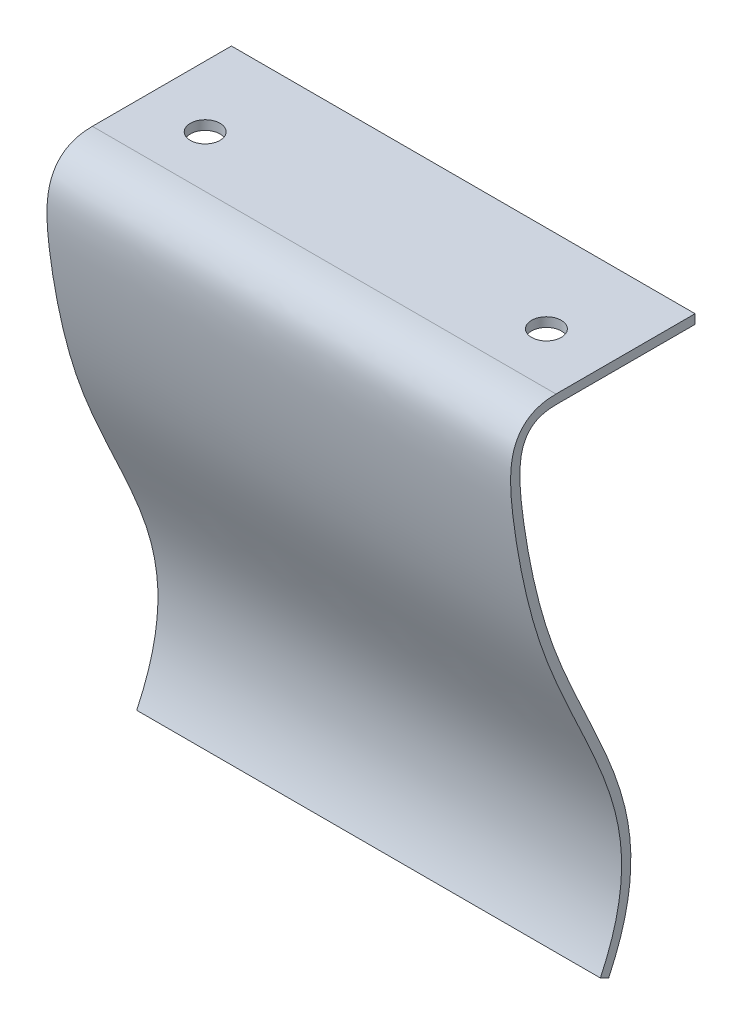
ISO-10303-21;
HEADER;
FILE_DESCRIPTION(('STEP AP214'),'2;1');
FILE_NAME('part.step','',(''),(''),'','','');
FILE_SCHEMA(('AUTOMOTIVE_DESIGN { 1 0 10303 214 1 1 1 1 }'));
ENDSEC;
DATA;
#1=APPLICATION_CONTEXT('core data for automotive mechanical design processes');
#2=APPLICATION_PROTOCOL_DEFINITION('international standard','automotive_design',2000,#1);
#3=PRODUCT_CONTEXT('',#1,'mechanical');
#4=PRODUCT('Part','Part','',(#3));
#5=PRODUCT_RELATED_PRODUCT_CATEGORY('part','',(#4));
#6=PRODUCT_DEFINITION_FORMATION('','',#4);
#7=PRODUCT_DEFINITION_CONTEXT('part definition',#1,'design');
#8=PRODUCT_DEFINITION('design','',#6,#7);
#9=PRODUCT_DEFINITION_SHAPE('','',#8);
#10=(LENGTH_UNIT() NAMED_UNIT(*) SI_UNIT(.MILLI.,.METRE.));
#11=(NAMED_UNIT(*) PLANE_ANGLE_UNIT() SI_UNIT($,.RADIAN.));
#12=(NAMED_UNIT(*) SI_UNIT($,.STERADIAN.) SOLID_ANGLE_UNIT());
#13=UNCERTAINTY_MEASURE_WITH_UNIT(LENGTH_MEASURE(1.E-05),#10,'distance_accuracy_value','');
#14=(GEOMETRIC_REPRESENTATION_CONTEXT(3) GLOBAL_UNCERTAINTY_ASSIGNED_CONTEXT((#13)) GLOBAL_UNIT_ASSIGNED_CONTEXT((#10,
#11,#12)) REPRESENTATION_CONTEXT('',''));
#15=CARTESIAN_POINT('',(0.,0.,0.));
#16=DIRECTION('',(0.,0.,1.));
#17=DIRECTION('',(1.,0.,0.));
#18=AXIS2_PLACEMENT_3D('',#15,#16,#17);
#19=CARTESIAN_POINT('',(50.,55.6225268925839,28.9315421718179));
#20=CARTESIAN_POINT('',(50.,55.6225268925839,29.5495301344915));
#21=CARTESIAN_POINT('',(50.,55.5566902092723,30.1141381036788));
#22=CARTESIAN_POINT('',(50.,55.2739407543996,31.1474005668499));
#23=CARTESIAN_POINT('',(50.,55.0542905873446,31.6162636528642));
#24=CARTESIAN_POINT('',(50.,54.4625233474366,32.4201172705438));
#25=CARTESIAN_POINT('',(50.,54.092295289197,32.7508722621553));
#26=CARTESIAN_POINT('',(50.,53.2681372067847,33.2584619481065));
#27=CARTESIAN_POINT('',(50.,52.8163288103807,33.4377510947691));
#28=CARTESIAN_POINT('',(50.,51.8647218768885,33.6889737009552));
#29=CARTESIAN_POINT('',(50.,51.3635518326052,33.7617957884789));
#30=CARTESIAN_POINT('',(50.,50.3127342333181,33.8358690496996));
#31=CARTESIAN_POINT('',(50.,49.7626729618878,33.8368472991819));
#32=CARTESIAN_POINT('',(50.,48.6136240125153,33.7889314955515));
#33=CARTESIAN_POINT('',(50.,48.0146306456055,33.7398721279512));
#34=CARTESIAN_POINT('',(50.,46.7711993394758,33.6090180869856));
#35=CARTESIAN_POINT('',(50.,46.1277071075903,33.5281899659987));
#36=CARTESIAN_POINT('',(50.,42.7917721000767,33.0664118071396));
#37=CARTESIAN_POINT('',(50.,39.7631098520036,32.4964336560825));
#38=CARTESIAN_POINT('',(50.,35.2938198277185,31.3171714152319));
#39=CARTESIAN_POINT('',(50.,33.8165219322822,30.8673443038037));
#40=CARTESIAN_POINT('',(50.,30.9886208921199,29.8658741634841));
#41=CARTESIAN_POINT('',(50.,29.6304834625541,29.3190360197982));
#42=CARTESIAN_POINT('',(50.,25.6866943233672,27.6203239020023));
#43=CARTESIAN_POINT('',(50.,23.2311976251864,26.4110003028312));
#44=CARTESIAN_POINT('',(50.,18.4733935224935,24.2514211214052));
#45=CARTESIAN_POINT('',(50.,16.1720681135011,23.3021197839043));
#46=CARTESIAN_POINT('',(50.,11.534502138506,22.041511098354));
#47=CARTESIAN_POINT('',(50.,9.20151696159139,21.7269450226703));
#48=CARTESIAN_POINT('',(50.,4.2424404774325,22.0843225688067));
#49=CARTESIAN_POINT('',(50.,1.60854700088082,22.7558749892393));
#50=CARTESIAN_POINT('',(50.,-1.31322203982244,24.1433398181167));
#51=B_SPLINE_CURVE_WITH_KNOTS('',3,(#19,#20,#21,#22,#23,#24,#25,#26,#27,#28,#29,#30,#31,#32,#33,
#34,#35,#36,#37,#38,#39,#40,#41,#42,#43,#44,#45,#46,#47,#48,#49,#50),.UNSPECIFIED.,.F.,.F.,(4,2,
2,2,2,2,2,2,2,2,2,2,2,2,2,4),(0.,0.0312499999999998,0.0624999999999997,0.0937499999999995,
0.124999999999999,0.156249999999999,0.187499999999999,0.218749999999999,0.249999999999999,
0.374999999999999,0.437499999999999,0.499999999999999,0.624999999999999,0.75,0.875,1.),.UNSPECIFIED.);
#52=DIRECTION('',(-1.,0.,0.));
#53=VECTOR('',#52,1.);
#54=SURFACE_OF_LINEAR_EXTRUSION('',#51,#53);
#55=CARTESIAN_POINT('',(0.,55.6225268925839,28.9315421718179));
#56=CARTESIAN_POINT('',(0.,55.6225268925839,29.5495301344915));
#57=CARTESIAN_POINT('',(0.,55.5566902092723,30.1141381036788));
#58=CARTESIAN_POINT('',(0.,55.2739407543996,31.1474005668499));
#59=CARTESIAN_POINT('',(0.,55.0542905873446,31.6162636528642));
#60=CARTESIAN_POINT('',(0.,54.4625233474366,32.4201172705438));
#61=CARTESIAN_POINT('',(0.,54.092295289197,32.7508722621553));
#62=CARTESIAN_POINT('',(0.,53.2681372067847,33.2584619481065));
#63=CARTESIAN_POINT('',(0.,52.8163288103807,33.4377510947691));
#64=CARTESIAN_POINT('',(0.,51.8647218768885,33.6889737009552));
#65=CARTESIAN_POINT('',(0.,51.3635518326052,33.7617957884789));
#66=CARTESIAN_POINT('',(0.,50.3127342333181,33.8358690496996));
#67=CARTESIAN_POINT('',(0.,49.7626729618878,33.8368472991819));
#68=CARTESIAN_POINT('',(0.,48.6136240125153,33.7889314955515));
#69=CARTESIAN_POINT('',(0.,48.0146306456055,33.7398721279512));
#70=CARTESIAN_POINT('',(0.,46.7711993394758,33.6090180869856));
#71=CARTESIAN_POINT('',(0.,46.1277071075903,33.5281899659987));
#72=CARTESIAN_POINT('',(0.,42.7917721000767,33.0664118071396));
#73=CARTESIAN_POINT('',(0.,39.7631098520036,32.4964336560825));
#74=CARTESIAN_POINT('',(0.,35.2938198277185,31.3171714152319));
#75=CARTESIAN_POINT('',(0.,33.8165219322822,30.8673443038037));
#76=CARTESIAN_POINT('',(0.,30.9886208921199,29.8658741634841));
#77=CARTESIAN_POINT('',(0.,29.6304834625541,29.3190360197982));
#78=CARTESIAN_POINT('',(0.,25.6866943233672,27.6203239020023));
#79=CARTESIAN_POINT('',(0.,23.2311976251864,26.4110003028312));
#80=CARTESIAN_POINT('',(0.,18.4733935224935,24.2514211214052));
#81=CARTESIAN_POINT('',(0.,16.1720681135011,23.3021197839043));
#82=CARTESIAN_POINT('',(0.,11.534502138506,22.041511098354));
#83=CARTESIAN_POINT('',(0.,9.20151696159139,21.7269450226703));
#84=CARTESIAN_POINT('',(0.,4.2424404774325,22.0843225688067));
#85=CARTESIAN_POINT('',(0.,1.60854700088082,22.7558749892393));
#86=CARTESIAN_POINT('',(0.,-1.31322203982244,24.1433398181167));
#87=B_SPLINE_CURVE_WITH_KNOTS('',3,(#55,#56,#57,#58,#59,#60,#61,#62,#63,#64,#65,#66,#67,#68,#69,
#70,#71,#72,#73,#74,#75,#76,#77,#78,#79,#80,#81,#82,#83,#84,#85,#86),.UNSPECIFIED.,.F.,.F.,(4,2,
2,2,2,2,2,2,2,2,2,2,2,2,2,4),(0.,0.0312499999999998,0.0624999999999997,0.0937499999999995,
0.124999999999999,0.156249999999999,0.187499999999999,0.218749999999999,0.249999999999999,
0.374999999999999,0.437499999999999,0.499999999999999,0.624999999999999,0.75,0.875,1.),.UNSPECIFIED.);
#88=CARTESIAN_POINT('',(0.,55.6225268925839,28.9315421718179));
#89=VERTEX_POINT('',#88);
#90=CARTESIAN_POINT('',(0.,-1.31322203982244,24.1433398181167));
#91=VERTEX_POINT('',#90);
#92=EDGE_CURVE('E123',#89,#91,#87,.T.);
#93=ORIENTED_EDGE('',*,*,#92,.T.);
#94=DIRECTION('',(-1.,0.,0.));
#95=VECTOR('',#94,1.);
#96=CARTESIAN_POINT('',(50.,-1.31322203982244,24.1433398181167));
#97=LINE('',#96,#95);
#98=CARTESIAN_POINT('',(50.,-1.31322203982244,24.1433398181167));
#99=VERTEX_POINT('',#98);
#100=EDGE_CURVE('E11',#99,#91,#97,.T.);
#101=ORIENTED_EDGE('',*,*,#100,.F.);
#102=CARTESIAN_POINT('',(50.,55.6225268925839,28.9315421718179));
#103=VERTEX_POINT('',#102);
#104=EDGE_CURVE('E88',#103,#99,#51,.T.);
#105=ORIENTED_EDGE('',*,*,#104,.F.);
#106=DIRECTION('',(-1.,0.,0.));
#107=VECTOR('',#106,1.);
#108=CARTESIAN_POINT('',(50.,55.6225268925839,28.9315421718179));
#109=LINE('',#108,#107);
#110=EDGE_CURVE('E119',#103,#89,#109,.T.);
#111=ORIENTED_EDGE('',*,*,#110,.T.);
#112=EDGE_LOOP('',(#93,#101,#105,#111));
#113=FACE_BOUND('',#112,.T.);
#114=ADVANCED_FACE('F41',(#113),#54,.F.);
#115=CARTESIAN_POINT('',(50.,-1.74218413909258,23.2400173300817));
#116=DIRECTION('',(0.,-0.903322488035007,0.428962099270139));
#117=DIRECTION('',(0.,-0.428962099270139,-0.903322488035007));
#118=AXIS2_PLACEMENT_3D('',#115,#116,#117);
#119=PLANE('',#118);
#120=DIRECTION('',(0.,0.428962099270139,0.903322488035007));
#121=VECTOR('',#120,1.);
#122=CARTESIAN_POINT('',(0.,-1.74218413909258,23.2400173300817));
#123=LINE('',#122,#121);
#124=CARTESIAN_POINT('',(0.,-1.74218413909258,23.2400173300817));
#125=VERTEX_POINT('',#124);
#126=EDGE_CURVE('E128',#125,#91,#123,.T.);
#127=ORIENTED_EDGE('',*,*,#126,.F.);
#128=DIRECTION('',(-1.,0.,0.));
#129=VECTOR('',#128,1.);
#130=CARTESIAN_POINT('',(50.,-1.74218413909258,23.2400173300817));
#131=LINE('',#130,#129);
#132=CARTESIAN_POINT('',(50.,-1.74218413909258,23.2400173300817));
#133=VERTEX_POINT('',#132);
#134=EDGE_CURVE('E50',#133,#125,#131,.T.);
#135=ORIENTED_EDGE('',*,*,#134,.F.);
#136=DIRECTION('',(0.,0.428962099270139,0.903322488035007));
#137=VECTOR('',#136,1.);
#138=CARTESIAN_POINT('',(50.,-1.74218413909258,23.2400173300817));
#139=LINE('',#138,#137);
#140=EDGE_CURVE('E186',#133,#99,#139,.T.);
#141=ORIENTED_EDGE('',*,*,#140,.T.);
#142=ORIENTED_EDGE('',*,*,#100,.T.);
#143=EDGE_LOOP('',(#127,#135,#141,#142));
#144=FACE_BOUND('',#143,.T.);
#145=ADVANCED_FACE('F155',(#144),#119,.T.);
#146=CARTESIAN_POINT('',(50.,54.6225268925839,28.9315421718179));
#147=CARTESIAN_POINT('',(50.,54.6225268925839,33.0624806148537));
#148=CARTESIAN_POINT('',(50.,48.6446791685099,33.2437625808467));
#149=CARTESIAN_POINT('',(50.,23.443395105597,28.3380028389398));
#150=CARTESIAN_POINT('',(50.,12.250446249325,16.5953160354382));
#151=CARTESIAN_POINT('',(50.,-1.74218413909258,23.2400173300817));
#152=B_SPLINE_CURVE_WITH_KNOTS('',3,(#146,#147,#148,#149,#150,#151),.UNSPECIFIED.,.F.,.F.,(4,1,
1,4),(0.,0.236283029465971,0.420799841596301,1.),.UNSPECIFIED.);
#153=DIRECTION('',(-1.,0.,0.));
#154=VECTOR('',#153,1.);
#155=SURFACE_OF_LINEAR_EXTRUSION('',#152,#154);
#156=CARTESIAN_POINT('',(0.,54.6225268925839,28.9315421718179));
#157=CARTESIAN_POINT('',(0.,54.6225268925839,33.0624806148537));
#158=CARTESIAN_POINT('',(0.,48.6446791685099,33.2437625808467));
#159=CARTESIAN_POINT('',(0.,23.443395105597,28.3380028389398));
#160=CARTESIAN_POINT('',(0.,12.250446249325,16.5953160354382));
#161=CARTESIAN_POINT('',(0.,-1.74218413909258,23.2400173300817));
#162=B_SPLINE_CURVE_WITH_KNOTS('',3,(#156,#157,#158,#159,#160,#161),.UNSPECIFIED.,.F.,.F.,(4,1,
1,4),(0.,0.236283029465971,0.420799841596301,1.),.UNSPECIFIED.);
#163=CARTESIAN_POINT('',(0.,54.6225268925839,28.9315421718179));
#164=VERTEX_POINT('',#163);
#165=EDGE_CURVE('E135',#164,#125,#162,.T.);
#166=ORIENTED_EDGE('',*,*,#165,.F.);
#167=DIRECTION('',(-1.,0.,0.));
#168=VECTOR('',#167,1.);
#169=CARTESIAN_POINT('',(50.,54.6225268925839,28.9315421718179));
#170=LINE('',#169,#168);
#171=CARTESIAN_POINT('',(50.,54.6225268925839,28.9315421718179));
#172=VERTEX_POINT('',#171);
#173=EDGE_CURVE('E109',#172,#164,#170,.T.);
#174=ORIENTED_EDGE('',*,*,#173,.F.);
#175=EDGE_CURVE('E115',#172,#133,#152,.T.);
#176=ORIENTED_EDGE('',*,*,#175,.T.);
#177=ORIENTED_EDGE('',*,*,#134,.T.);
#178=EDGE_LOOP('',(#166,#174,#176,#177));
#179=FACE_BOUND('',#178,.T.);
#180=ADVANCED_FACE('F152',(#179),#155,.T.);
#181=CARTESIAN_POINT('',(50.,54.6225268925839,13.9315421718179));
#182=DIRECTION('',(0.,-1.,0.));
#183=DIRECTION('',(0.,0.,-1.));
#184=AXIS2_PLACEMENT_3D('',#181,#182,#183);
#185=PLANE('',#184);
#186=CARTESIAN_POINT('',(43.4,54.6225268925839,23.3615421718179));
#187=DIRECTION('',(0.,-1.,0.));
#188=DIRECTION('',(0.,0.,-1.));
#189=AXIS2_PLACEMENT_3D('',#186,#187,#188);
#190=CIRCLE('',#189,1.6);
#191=CARTESIAN_POINT('',(43.4,54.6225268925839,21.7615421718179));
#192=VERTEX_POINT('',#191);
#193=EDGE_CURVE('E203',#192,#192,#190,.F.);
#194=ORIENTED_EDGE('',*,*,#193,.T.);
#195=EDGE_LOOP('',(#194));
#196=FACE_BOUND('',#195,.T.);
#197=CARTESIAN_POINT('',(6.6,54.6225268925839,23.3615421718179));
#198=DIRECTION('',(0.,-1.,0.));
#199=DIRECTION('',(0.,0.,-1.));
#200=AXIS2_PLACEMENT_3D('',#197,#198,#199);
#201=CIRCLE('',#200,1.6);
#202=CARTESIAN_POINT('',(6.6,54.6225268925839,21.7615421718179));
#203=VERTEX_POINT('',#202);
#204=EDGE_CURVE('E194',#203,#203,#201,.F.);
#205=ORIENTED_EDGE('',*,*,#204,.T.);
#206=EDGE_LOOP('',(#205));
#207=FACE_BOUND('',#206,.T.);
#208=DIRECTION('',(0.,0.,1.));
#209=VECTOR('',#208,1.);
#210=CARTESIAN_POINT('',(0.,54.6225268925839,13.9315421718179));
#211=LINE('',#210,#209);
#212=CARTESIAN_POINT('',(0.,54.6225268925839,13.9315421718179));
#213=VERTEX_POINT('',#212);
#214=EDGE_CURVE('E104',#213,#164,#211,.T.);
#215=ORIENTED_EDGE('',*,*,#214,.F.);
#216=DIRECTION('',(-1.,0.,0.));
#217=VECTOR('',#216,1.);
#218=CARTESIAN_POINT('',(50.,54.6225268925839,13.9315421718179));
#219=LINE('',#218,#217);
#220=CARTESIAN_POINT('',(50.,54.6225268925839,13.9315421718179));
#221=VERTEX_POINT('',#220);
#222=EDGE_CURVE('E99',#221,#213,#219,.T.);
#223=ORIENTED_EDGE('',*,*,#222,.F.);
#224=DIRECTION('',(0.,0.,1.));
#225=VECTOR('',#224,1.);
#226=CARTESIAN_POINT('',(50.,54.6225268925839,13.9315421718179));
#227=LINE('',#226,#225);
#228=EDGE_CURVE('E102',#221,#172,#227,.T.);
#229=ORIENTED_EDGE('',*,*,#228,.T.);
#230=ORIENTED_EDGE('',*,*,#173,.T.);
#231=EDGE_LOOP('',(#215,#223,#229,#230));
#232=FACE_BOUND('',#231,.T.);
#233=ADVANCED_FACE('F101',(#196,#207,#232),#185,.T.);
#234=CARTESIAN_POINT('',(50.,55.6225268925839,13.9315421718179));
#235=DIRECTION('',(0.,0.,-1.));
#236=DIRECTION('',(-1.,0.,0.));
#237=AXIS2_PLACEMENT_3D('',#234,#235,#236);
#238=PLANE('',#237);
#239=DIRECTION('',(0.,-1.,0.));
#240=VECTOR('',#239,1.);
#241=CARTESIAN_POINT('',(0.,55.6225268925839,13.9315421718179));
#242=LINE('',#241,#240);
#243=CARTESIAN_POINT('',(0.,55.6225268925839,13.9315421718179));
#244=VERTEX_POINT('',#243);
#245=EDGE_CURVE('E144',#244,#213,#242,.T.);
#246=ORIENTED_EDGE('',*,*,#245,.F.);
#247=DIRECTION('',(-1.,0.,0.));
#248=VECTOR('',#247,1.);
#249=CARTESIAN_POINT('',(50.,55.6225268925839,13.9315421718179));
#250=LINE('',#249,#248);
#251=CARTESIAN_POINT('',(50.,55.6225268925839,13.9315421718179));
#252=VERTEX_POINT('',#251);
#253=EDGE_CURVE('E79',#252,#244,#250,.T.);
#254=ORIENTED_EDGE('',*,*,#253,.F.);
#255=DIRECTION('',(0.,-1.,0.));
#256=VECTOR('',#255,1.);
#257=CARTESIAN_POINT('',(50.,55.6225268925839,13.9315421718179));
#258=LINE('',#257,#256);
#259=EDGE_CURVE('E113',#252,#221,#258,.T.);
#260=ORIENTED_EDGE('',*,*,#259,.T.);
#261=ORIENTED_EDGE('',*,*,#222,.T.);
#262=EDGE_LOOP('',(#246,#254,#260,#261));
#263=FACE_BOUND('',#262,.T.);
#264=ADVANCED_FACE('F117',(#263),#238,.T.);
#265=CARTESIAN_POINT('',(50.,55.6225268925839,13.9315421718179));
#266=DIRECTION('',(0.,-1.,0.));
#267=DIRECTION('',(0.,0.,-1.));
#268=AXIS2_PLACEMENT_3D('',#265,#266,#267);
#269=PLANE('',#268);
#270=CARTESIAN_POINT('',(43.4,55.6225268925839,23.3615421718179));
#271=DIRECTION('',(0.,1.,0.));
#272=DIRECTION('',(0.,0.,1.));
#273=AXIS2_PLACEMENT_3D('',#270,#271,#272);
#274=CIRCLE('',#273,1.6);
#275=CARTESIAN_POINT('',(43.4,55.6225268925839,24.9615421718179));
#276=VERTEX_POINT('',#275);
#277=EDGE_CURVE('E200',#276,#276,#274,.T.);
#278=ORIENTED_EDGE('',*,*,#277,.F.);
#279=EDGE_LOOP('',(#278));
#280=FACE_BOUND('',#279,.T.);
#281=CARTESIAN_POINT('',(6.6,55.6225268925839,23.3615421718179));
#282=DIRECTION('',(0.,1.,0.));
#283=DIRECTION('',(0.,0.,1.));
#284=AXIS2_PLACEMENT_3D('',#281,#282,#283);
#285=CIRCLE('',#284,1.6);
#286=CARTESIAN_POINT('',(6.6,55.6225268925839,24.9615421718179));
#287=VERTEX_POINT('',#286);
#288=EDGE_CURVE('E129',#287,#287,#285,.T.);
#289=ORIENTED_EDGE('',*,*,#288,.F.);
#290=EDGE_LOOP('',(#289));
#291=FACE_BOUND('',#290,.T.);
#292=DIRECTION('',(0.,0.,-1.));
#293=VECTOR('',#292,1.);
#294=CARTESIAN_POINT('',(0.,55.6225268925839,13.9315421718179));
#295=LINE('',#294,#293);
#296=EDGE_CURVE('E82',#244,#89,#295,.F.);
#297=ORIENTED_EDGE('',*,*,#296,.T.);
#298=ORIENTED_EDGE('',*,*,#110,.F.);
#299=DIRECTION('',(0.,0.,-1.));
#300=VECTOR('',#299,1.);
#301=CARTESIAN_POINT('',(50.,55.6225268925839,13.9315421718179));
#302=LINE('',#301,#300);
#303=EDGE_CURVE('E58',#252,#103,#302,.F.);
#304=ORIENTED_EDGE('',*,*,#303,.F.);
#305=ORIENTED_EDGE('',*,*,#253,.T.);
#306=EDGE_LOOP('',(#297,#298,#304,#305));
#307=FACE_BOUND('',#306,.T.);
#308=ADVANCED_FACE('F160',(#280,#291,#307),#269,.F.);
#309=CARTESIAN_POINT('',(50.,28.3158870828251,28.7527986471995));
#310=DIRECTION('',(-1.,0.,0.));
#311=DIRECTION('',(0.,0.,1.));
#312=AXIS2_PLACEMENT_3D('',#309,#310,#311);
#313=PLANE('',#312);
#314=ORIENTED_EDGE('',*,*,#104,.T.);
#315=ORIENTED_EDGE('',*,*,#140,.F.);
#316=ORIENTED_EDGE('',*,*,#175,.F.);
#317=ORIENTED_EDGE('',*,*,#228,.F.);
#318=ORIENTED_EDGE('',*,*,#259,.F.);
#319=ORIENTED_EDGE('',*,*,#303,.T.);
#320=EDGE_LOOP('',(#314,#315,#316,#317,#318,#319));
#321=FACE_BOUND('',#320,.T.);
#322=ADVANCED_FACE('F112',(#321),#313,.F.);
#323=CARTESIAN_POINT('',(0.,28.3158870828251,28.7527986471995));
#324=DIRECTION('',(-1.,0.,0.));
#325=DIRECTION('',(0.,0.,1.));
#326=AXIS2_PLACEMENT_3D('',#323,#324,#325);
#327=PLANE('',#326);
#328=ORIENTED_EDGE('',*,*,#92,.F.);
#329=ORIENTED_EDGE('',*,*,#296,.F.);
#330=ORIENTED_EDGE('',*,*,#245,.T.);
#331=ORIENTED_EDGE('',*,*,#214,.T.);
#332=ORIENTED_EDGE('',*,*,#165,.T.);
#333=ORIENTED_EDGE('',*,*,#126,.T.);
#334=EDGE_LOOP('',(#328,#329,#330,#331,#332,#333));
#335=FACE_BOUND('',#334,.T.);
#336=ADVANCED_FACE('F158',(#335),#327,.T.);
#337=CARTESIAN_POINT('',(6.6,-1.74318413909258,23.3615421718179));
#338=DIRECTION('',(0.,1.,0.));
#339=DIRECTION('',(0.,0.,1.));
#340=AXIS2_PLACEMENT_3D('',#337,#338,#339);
#341=CYLINDRICAL_SURFACE('',#340,1.6);
#342=ORIENTED_EDGE('',*,*,#204,.F.);
#343=EDGE_LOOP('',(#342));
#344=FACE_BOUND('',#343,.T.);
#345=ORIENTED_EDGE('',*,*,#288,.T.);
#346=EDGE_LOOP('',(#345));
#347=FACE_BOUND('',#346,.T.);
#348=ADVANCED_FACE('F210',(#344,#347),#341,.F.);
#349=CARTESIAN_POINT('',(43.4,-1.74318413909258,23.3615421718179));
#350=DIRECTION('',(0.,1.,0.));
#351=DIRECTION('',(0.,0.,1.));
#352=AXIS2_PLACEMENT_3D('',#349,#350,#351);
#353=CYLINDRICAL_SURFACE('',#352,1.6);
#354=ORIENTED_EDGE('',*,*,#193,.F.);
#355=EDGE_LOOP('',(#354));
#356=FACE_BOUND('',#355,.T.);
#357=ORIENTED_EDGE('',*,*,#277,.T.);
#358=EDGE_LOOP('',(#357));
#359=FACE_BOUND('',#358,.T.);
#360=ADVANCED_FACE('F208',(#356,#359),#353,.F.);
#361=CLOSED_SHELL('',(#114,#145,#180,#233,#264,#308,#322,#336,#348,#360));
#362=MANIFOLD_SOLID_BREP('B2',#361);
#363=ADVANCED_BREP_SHAPE_REPRESENTATION('',(#18,#362),#14);
#364=SHAPE_DEFINITION_REPRESENTATION(#9,#363);
ENDSEC;
END-ISO-10303-21;
